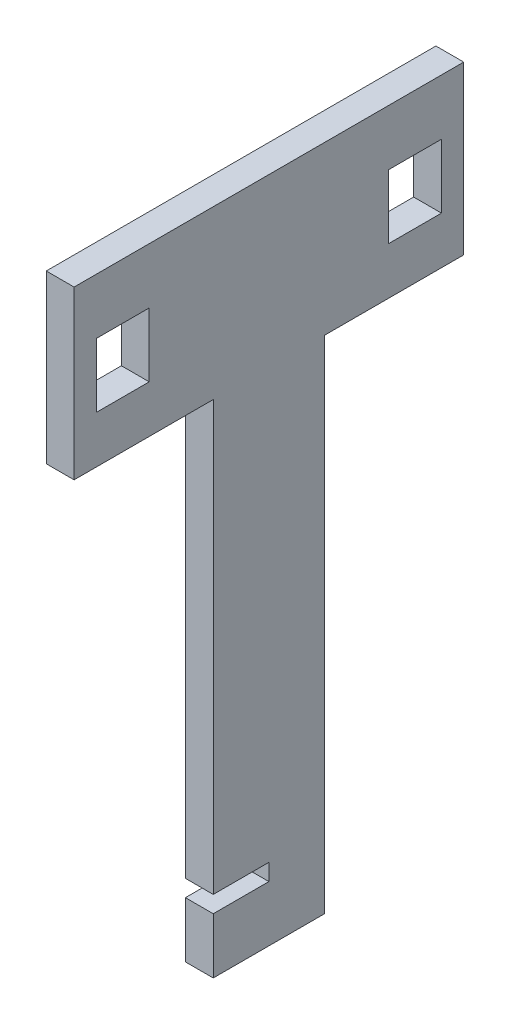
ISO-10303-21;
HEADER;
FILE_DESCRIPTION(('STEP AP214'),'2;1');
FILE_NAME('part.step','',(''),(''),'','','');
FILE_SCHEMA(('AUTOMOTIVE_DESIGN { 1 0 10303 214 1 1 1 1 }'));
ENDSEC;
DATA;
#1=APPLICATION_CONTEXT('core data for automotive mechanical design processes');
#2=APPLICATION_PROTOCOL_DEFINITION('international standard','automotive_design',2000,#1);
#3=PRODUCT_CONTEXT('',#1,'mechanical');
#4=PRODUCT('Part','Part','',(#3));
#5=PRODUCT_RELATED_PRODUCT_CATEGORY('part','',(#4));
#6=PRODUCT_DEFINITION_FORMATION('','',#4);
#7=PRODUCT_DEFINITION_CONTEXT('part definition',#1,'design');
#8=PRODUCT_DEFINITION('design','',#6,#7);
#9=PRODUCT_DEFINITION_SHAPE('','',#8);
#10=(LENGTH_UNIT() NAMED_UNIT(*) SI_UNIT(.MILLI.,.METRE.));
#11=(NAMED_UNIT(*) PLANE_ANGLE_UNIT() SI_UNIT($,.RADIAN.));
#12=(NAMED_UNIT(*) SI_UNIT($,.STERADIAN.) SOLID_ANGLE_UNIT());
#13=UNCERTAINTY_MEASURE_WITH_UNIT(LENGTH_MEASURE(1.E-05),#10,'distance_accuracy_value','');
#14=(GEOMETRIC_REPRESENTATION_CONTEXT(3) GLOBAL_UNCERTAINTY_ASSIGNED_CONTEXT((#13)) GLOBAL_UNIT_ASSIGNED_CONTEXT((#10,
#11,#12)) REPRESENTATION_CONTEXT('',''));
#15=CARTESIAN_POINT('',(0.,0.,0.));
#16=DIRECTION('',(0.,0.,1.));
#17=DIRECTION('',(1.,0.,0.));
#18=AXIS2_PLACEMENT_3D('',#15,#16,#17);
#19=CARTESIAN_POINT('',(0.,0.,70.));
#20=DIRECTION('',(-1.,0.,0.));
#21=DIRECTION('',(0.,0.,1.));
#22=AXIS2_PLACEMENT_3D('',#19,#20,#21);
#23=PLANE('',#22);
#24=DIRECTION('',(0.,0.,-1.));
#25=VECTOR('',#24,1.);
#26=CARTESIAN_POINT('',(0.,90.,70.));
#27=LINE('',#26,#25);
#28=CARTESIAN_POINT('',(0.,90.,70.));
#29=VERTEX_POINT('',#28);
#30=CARTESIAN_POINT('',(0.,90.,45.));
#31=VERTEX_POINT('',#30);
#32=EDGE_CURVE('E252',#29,#31,#27,.T.);
#33=ORIENTED_EDGE('',*,*,#32,.F.);
#34=DIRECTION('',(0.,1.,0.));
#35=VECTOR('',#34,1.);
#36=CARTESIAN_POINT('',(0.,0.,70.));
#37=LINE('',#36,#35);
#38=CARTESIAN_POINT('',(0.,120.,70.));
#39=VERTEX_POINT('',#38);
#40=EDGE_CURVE('E373',#29,#39,#37,.T.);
#41=ORIENTED_EDGE('',*,*,#40,.T.);
#42=DIRECTION('',(0.,0.,-1.));
#43=VECTOR('',#42,1.);
#44=CARTESIAN_POINT('',(0.,120.,70.));
#45=LINE('',#44,#43);
#46=CARTESIAN_POINT('',(0.,120.,0.));
#47=VERTEX_POINT('',#46);
#48=EDGE_CURVE('E216',#39,#47,#45,.T.);
#49=ORIENTED_EDGE('',*,*,#48,.T.);
#50=DIRECTION('',(0.,1.,0.));
#51=VECTOR('',#50,1.);
#52=CARTESIAN_POINT('',(0.,0.,0.));
#53=LINE('',#52,#51);
#54=CARTESIAN_POINT('',(0.,90.,0.));
#55=VERTEX_POINT('',#54);
#56=EDGE_CURVE('E382',#55,#47,#53,.T.);
#57=ORIENTED_EDGE('',*,*,#56,.F.);
#58=DIRECTION('',(0.,0.,-1.));
#59=VECTOR('',#58,1.);
#60=CARTESIAN_POINT('',(0.,90.,70.));
#61=LINE('',#60,#59);
#62=CARTESIAN_POINT('',(0.,90.,25.));
#63=VERTEX_POINT('',#62);
#64=EDGE_CURVE('E57',#63,#55,#61,.T.);
#65=ORIENTED_EDGE('',*,*,#64,.F.);
#66=DIRECTION('',(0.,1.,0.));
#67=VECTOR('',#66,1.);
#68=CARTESIAN_POINT('',(0.,0.,25.));
#69=LINE('',#68,#67);
#70=CARTESIAN_POINT('',(0.,0.,25.));
#71=VERTEX_POINT('',#70);
#72=EDGE_CURVE('E249',#71,#63,#69,.T.);
#73=ORIENTED_EDGE('',*,*,#72,.F.);
#74=DIRECTION('',(0.,0.,-1.));
#75=VECTOR('',#74,1.);
#76=CARTESIAN_POINT('',(0.,0.,70.));
#77=LINE('',#76,#75);
#78=CARTESIAN_POINT('',(0.,0.,45.));
#79=VERTEX_POINT('',#78);
#80=EDGE_CURVE('E211',#79,#71,#77,.T.);
#81=ORIENTED_EDGE('',*,*,#80,.F.);
#82=DIRECTION('',(0.,-1.,0.));
#83=VECTOR('',#82,1.);
#84=CARTESIAN_POINT('',(0.,0.,45.));
#85=LINE('',#84,#83);
#86=CARTESIAN_POINT('',(0.,10.,45.));
#87=VERTEX_POINT('',#86);
#88=EDGE_CURVE('E185',#87,#79,#85,.T.);
#89=ORIENTED_EDGE('',*,*,#88,.F.);
#90=DIRECTION('',(0.,0.,-1.));
#91=VECTOR('',#90,1.);
#92=CARTESIAN_POINT('',(0.,10.,70.));
#93=LINE('',#92,#91);
#94=CARTESIAN_POINT('',(0.,10.,35.));
#95=VERTEX_POINT('',#94);
#96=EDGE_CURVE('E231',#87,#95,#93,.T.);
#97=ORIENTED_EDGE('',*,*,#96,.T.);
#98=DIRECTION('',(0.,1.,0.));
#99=VECTOR('',#98,1.);
#100=CARTESIAN_POINT('',(0.,10.,35.));
#101=LINE('',#100,#99);
#102=CARTESIAN_POINT('',(0.,13.,35.));
#103=VERTEX_POINT('',#102);
#104=EDGE_CURVE('E345',#95,#103,#101,.T.);
#105=ORIENTED_EDGE('',*,*,#104,.T.);
#106=DIRECTION('',(0.,0.,1.));
#107=VECTOR('',#106,1.);
#108=CARTESIAN_POINT('',(0.,13.,70.));
#109=LINE('',#108,#107);
#110=CARTESIAN_POINT('',(0.,13.,45.));
#111=VERTEX_POINT('',#110);
#112=EDGE_CURVE('E349',#103,#111,#109,.T.);
#113=ORIENTED_EDGE('',*,*,#112,.T.);
#114=EDGE_CURVE('E64',#31,#111,#85,.T.);
#115=ORIENTED_EDGE('',*,*,#114,.F.);
#116=EDGE_LOOP('',(#33,#41,#49,#57,#65,#73,#81,#89,#97,#105,#113,#115));
#117=FACE_BOUND('',#116,.T.);
#118=DIRECTION('',(0.,0.,-1.));
#119=VECTOR('',#118,1.);
#120=CARTESIAN_POINT('',(0.,98.5,70.0000000000001));
#121=LINE('',#120,#119);
#122=CARTESIAN_POINT('',(0.,98.5,66.));
#123=VERTEX_POINT('',#122);
#124=CARTESIAN_POINT('',(0.,98.5,56.5));
#125=VERTEX_POINT('',#124);
#126=EDGE_CURVE('E306',#123,#125,#121,.T.);
#127=ORIENTED_EDGE('',*,*,#126,.T.);
#128=DIRECTION('',(0.,1.,0.));
#129=VECTOR('',#128,1.);
#130=CARTESIAN_POINT('',(0.,0.,56.4999999999999));
#131=LINE('',#130,#129);
#132=CARTESIAN_POINT('',(0.,110.,56.5));
#133=VERTEX_POINT('',#132);
#134=EDGE_CURVE('E257',#125,#133,#131,.T.);
#135=ORIENTED_EDGE('',*,*,#134,.T.);
#136=DIRECTION('',(0.,0.,1.));
#137=VECTOR('',#136,1.);
#138=CARTESIAN_POINT('',(0.,110.,70.0000000000002));
#139=LINE('',#138,#137);
#140=CARTESIAN_POINT('',(0.,110.,66.));
#141=VERTEX_POINT('',#140);
#142=EDGE_CURVE('E320',#133,#141,#139,.T.);
#143=ORIENTED_EDGE('',*,*,#142,.T.);
#144=DIRECTION('',(0.,-1.,0.));
#145=VECTOR('',#144,1.);
#146=CARTESIAN_POINT('',(0.,0.,66.));
#147=LINE('',#146,#145);
#148=EDGE_CURVE('E324',#141,#123,#147,.T.);
#149=ORIENTED_EDGE('',*,*,#148,.T.);
#150=EDGE_LOOP('',(#127,#135,#143,#149));
#151=FACE_BOUND('',#150,.T.);
#152=DIRECTION('',(0.,0.,1.));
#153=VECTOR('',#152,1.);
#154=CARTESIAN_POINT('',(0.,110.,70.));
#155=LINE('',#154,#153);
#156=CARTESIAN_POINT('',(0.,110.,4.));
#157=VERTEX_POINT('',#156);
#158=CARTESIAN_POINT('',(0.,110.,13.5));
#159=VERTEX_POINT('',#158);
#160=EDGE_CURVE('E262',#157,#159,#155,.T.);
#161=ORIENTED_EDGE('',*,*,#160,.T.);
#162=DIRECTION('',(0.,-1.,0.));
#163=VECTOR('',#162,1.);
#164=CARTESIAN_POINT('',(0.,0.,13.5));
#165=LINE('',#164,#163);
#166=CARTESIAN_POINT('',(0.,98.5,13.5));
#167=VERTEX_POINT('',#166);
#168=EDGE_CURVE('E273',#159,#167,#165,.T.);
#169=ORIENTED_EDGE('',*,*,#168,.T.);
#170=DIRECTION('',(0.,0.,-1.));
#171=VECTOR('',#170,1.);
#172=CARTESIAN_POINT('',(0.,98.5,70.));
#173=LINE('',#172,#171);
#174=CARTESIAN_POINT('',(0.,98.5,4.));
#175=VERTEX_POINT('',#174);
#176=EDGE_CURVE('E277',#167,#175,#173,.T.);
#177=ORIENTED_EDGE('',*,*,#176,.T.);
#178=DIRECTION('',(0.,1.,0.));
#179=VECTOR('',#178,1.);
#180=CARTESIAN_POINT('',(0.,0.,3.99999999999999));
#181=LINE('',#180,#179);
#182=EDGE_CURVE('E282',#175,#157,#181,.T.);
#183=ORIENTED_EDGE('',*,*,#182,.T.);
#184=EDGE_LOOP('',(#161,#169,#177,#183));
#185=FACE_BOUND('',#184,.T.);
#186=ADVANCED_FACE('F41',(#117,#151,#185),#23,.T.);
#187=CARTESIAN_POINT('',(5.,0.,70.));
#188=DIRECTION('',(-1.,0.,0.));
#189=DIRECTION('',(0.,0.,1.));
#190=AXIS2_PLACEMENT_3D('',#187,#188,#189);
#191=PLANE('',#190);
#192=DIRECTION('',(0.,1.,0.));
#193=VECTOR('',#192,1.);
#194=CARTESIAN_POINT('',(5.,0.,56.4999999999999));
#195=LINE('',#194,#193);
#196=CARTESIAN_POINT('',(5.,98.5,56.5));
#197=VERTEX_POINT('',#196);
#198=CARTESIAN_POINT('',(5.,110.,56.5));
#199=VERTEX_POINT('',#198);
#200=EDGE_CURVE('E302',#197,#199,#195,.T.);
#201=ORIENTED_EDGE('',*,*,#200,.F.);
#202=DIRECTION('',(0.,0.,-1.));
#203=VECTOR('',#202,1.);
#204=CARTESIAN_POINT('',(5.,98.5,70.0000000000001));
#205=LINE('',#204,#203);
#206=CARTESIAN_POINT('',(5.,98.5,66.));
#207=VERTEX_POINT('',#206);
#208=EDGE_CURVE('E313',#207,#197,#205,.T.);
#209=ORIENTED_EDGE('',*,*,#208,.F.);
#210=DIRECTION('',(0.,-1.,0.));
#211=VECTOR('',#210,1.);
#212=CARTESIAN_POINT('',(5.,0.,66.));
#213=LINE('',#212,#211);
#214=CARTESIAN_POINT('',(5.,110.,66.));
#215=VERTEX_POINT('',#214);
#216=EDGE_CURVE('E309',#215,#207,#213,.T.);
#217=ORIENTED_EDGE('',*,*,#216,.F.);
#218=DIRECTION('',(0.,0.,1.));
#219=VECTOR('',#218,1.);
#220=CARTESIAN_POINT('',(5.,110.,70.0000000000002));
#221=LINE('',#220,#219);
#222=EDGE_CURVE('E305',#199,#215,#221,.T.);
#223=ORIENTED_EDGE('',*,*,#222,.F.);
#224=EDGE_LOOP('',(#201,#209,#217,#223));
#225=FACE_BOUND('',#224,.T.);
#226=DIRECTION('',(0.,1.,0.));
#227=VECTOR('',#226,1.);
#228=CARTESIAN_POINT('',(5.,0.,70.));
#229=LINE('',#228,#227);
#230=CARTESIAN_POINT('',(5.,90.,70.));
#231=VERTEX_POINT('',#230);
#232=CARTESIAN_POINT('',(5.,120.,70.));
#233=VERTEX_POINT('',#232);
#234=EDGE_CURVE('E219',#231,#233,#229,.T.);
#235=ORIENTED_EDGE('',*,*,#234,.F.);
#236=DIRECTION('',(0.,0.,1.));
#237=VECTOR('',#236,1.);
#238=CARTESIAN_POINT('',(5.,90.,70.));
#239=LINE('',#238,#237);
#240=CARTESIAN_POINT('',(5.,90.,45.));
#241=VERTEX_POINT('',#240);
#242=EDGE_CURVE('E192',#241,#231,#239,.T.);
#243=ORIENTED_EDGE('',*,*,#242,.F.);
#244=DIRECTION('',(0.,1.,0.));
#245=VECTOR('',#244,1.);
#246=CARTESIAN_POINT('',(5.,90.,45.));
#247=LINE('',#246,#245);
#248=CARTESIAN_POINT('',(5.,13.,45.));
#249=VERTEX_POINT('',#248);
#250=EDGE_CURVE('E205',#249,#241,#247,.T.);
#251=ORIENTED_EDGE('',*,*,#250,.F.);
#252=DIRECTION('',(0.,0.,1.));
#253=VECTOR('',#252,1.);
#254=CARTESIAN_POINT('',(5.,13.,70.));
#255=LINE('',#254,#253);
#256=CARTESIAN_POINT('',(5.,13.,35.));
#257=VERTEX_POINT('',#256);
#258=EDGE_CURVE('E346',#257,#249,#255,.T.);
#259=ORIENTED_EDGE('',*,*,#258,.F.);
#260=DIRECTION('',(0.,1.,0.));
#261=VECTOR('',#260,1.);
#262=CARTESIAN_POINT('',(5.,10.,35.));
#263=LINE('',#262,#261);
#264=CARTESIAN_POINT('',(5.,10.,35.));
#265=VERTEX_POINT('',#264);
#266=EDGE_CURVE('E356',#265,#257,#263,.T.);
#267=ORIENTED_EDGE('',*,*,#266,.F.);
#268=DIRECTION('',(0.,0.,-1.));
#269=VECTOR('',#268,1.);
#270=CARTESIAN_POINT('',(5.,10.,70.));
#271=LINE('',#270,#269);
#272=CARTESIAN_POINT('',(5.,10.,45.));
#273=VERTEX_POINT('',#272);
#274=EDGE_CURVE('E203',#273,#265,#271,.T.);
#275=ORIENTED_EDGE('',*,*,#274,.F.);
#276=CARTESIAN_POINT('',(5.,0.,45.));
#277=VERTEX_POINT('',#276);
#278=EDGE_CURVE('E182',#277,#273,#247,.T.);
#279=ORIENTED_EDGE('',*,*,#278,.F.);
#280=DIRECTION('',(0.,0.,-1.));
#281=VECTOR('',#280,1.);
#282=CARTESIAN_POINT('',(5.,0.,70.));
#283=LINE('',#282,#281);
#284=CARTESIAN_POINT('',(5.,0.,25.));
#285=VERTEX_POINT('',#284);
#286=EDGE_CURVE('E201',#277,#285,#283,.T.);
#287=ORIENTED_EDGE('',*,*,#286,.T.);
#288=DIRECTION('',(0.,-1.,0.));
#289=VECTOR('',#288,1.);
#290=CARTESIAN_POINT('',(5.,90.,25.));
#291=LINE('',#290,#289);
#292=CARTESIAN_POINT('',(5.,90.,25.));
#293=VERTEX_POINT('',#292);
#294=EDGE_CURVE('E412',#293,#285,#291,.T.);
#295=ORIENTED_EDGE('',*,*,#294,.F.);
#296=DIRECTION('',(0.,0.,1.));
#297=VECTOR('',#296,1.);
#298=CARTESIAN_POINT('',(5.,90.,0.));
#299=LINE('',#298,#297);
#300=CARTESIAN_POINT('',(5.,90.,0.));
#301=VERTEX_POINT('',#300);
#302=EDGE_CURVE('E389',#301,#293,#299,.T.);
#303=ORIENTED_EDGE('',*,*,#302,.F.);
#304=DIRECTION('',(0.,1.,0.));
#305=VECTOR('',#304,1.);
#306=CARTESIAN_POINT('',(5.,0.,0.));
#307=LINE('',#306,#305);
#308=CARTESIAN_POINT('',(5.,120.,0.));
#309=VERTEX_POINT('',#308);
#310=EDGE_CURVE('E374',#301,#309,#307,.T.);
#311=ORIENTED_EDGE('',*,*,#310,.T.);
#312=DIRECTION('',(0.,0.,-1.));
#313=VECTOR('',#312,1.);
#314=CARTESIAN_POINT('',(5.,120.,70.));
#315=LINE('',#314,#313);
#316=EDGE_CURVE('E212',#233,#309,#315,.T.);
#317=ORIENTED_EDGE('',*,*,#316,.F.);
#318=EDGE_LOOP('',(#235,#243,#251,#259,#267,#275,#279,#287,#295,#303,#311,#317));
#319=FACE_BOUND('',#318,.T.);
#320=DIRECTION('',(0.,-1.,0.));
#321=VECTOR('',#320,1.);
#322=CARTESIAN_POINT('',(5.,0.,13.5));
#323=LINE('',#322,#321);
#324=CARTESIAN_POINT('',(5.,110.,13.5));
#325=VERTEX_POINT('',#324);
#326=CARTESIAN_POINT('',(5.,98.5,13.5));
#327=VERTEX_POINT('',#326);
#328=EDGE_CURVE('E258',#325,#327,#323,.T.);
#329=ORIENTED_EDGE('',*,*,#328,.F.);
#330=DIRECTION('',(0.,0.,1.));
#331=VECTOR('',#330,1.);
#332=CARTESIAN_POINT('',(5.,110.,70.));
#333=LINE('',#332,#331);
#334=CARTESIAN_POINT('',(5.,110.,4.));
#335=VERTEX_POINT('',#334);
#336=EDGE_CURVE('E269',#335,#325,#333,.T.);
#337=ORIENTED_EDGE('',*,*,#336,.F.);
#338=DIRECTION('',(0.,1.,0.));
#339=VECTOR('',#338,1.);
#340=CARTESIAN_POINT('',(5.,0.,3.99999999999999));
#341=LINE('',#340,#339);
#342=CARTESIAN_POINT('',(5.,98.5,4.));
#343=VERTEX_POINT('',#342);
#344=EDGE_CURVE('E265',#343,#335,#341,.T.);
#345=ORIENTED_EDGE('',*,*,#344,.F.);
#346=DIRECTION('',(0.,0.,-1.));
#347=VECTOR('',#346,1.);
#348=CARTESIAN_POINT('',(5.,98.5,70.));
#349=LINE('',#348,#347);
#350=EDGE_CURVE('E261',#327,#343,#349,.T.);
#351=ORIENTED_EDGE('',*,*,#350,.F.);
#352=EDGE_LOOP('',(#329,#337,#345,#351));
#353=FACE_BOUND('',#352,.T.);
#354=ADVANCED_FACE('F198',(#225,#319,#353),#191,.F.);
#355=CARTESIAN_POINT('',(0.,0.,70.));
#356=DIRECTION('',(0.,0.,1.));
#357=DIRECTION('',(1.,0.,0.));
#358=AXIS2_PLACEMENT_3D('',#355,#356,#357);
#359=PLANE('',#358);
#360=DIRECTION('',(1.,0.,0.));
#361=VECTOR('',#360,1.);
#362=CARTESIAN_POINT('',(-5.,90.,70.));
#363=LINE('',#362,#361);
#364=EDGE_CURVE('E239',#29,#231,#363,.T.);
#365=ORIENTED_EDGE('',*,*,#364,.T.);
#366=ORIENTED_EDGE('',*,*,#234,.T.);
#367=DIRECTION('',(1.,0.,0.));
#368=VECTOR('',#367,1.);
#369=CARTESIAN_POINT('',(0.,120.,70.));
#370=LINE('',#369,#368);
#371=EDGE_CURVE('E369',#39,#233,#370,.T.);
#372=ORIENTED_EDGE('',*,*,#371,.F.);
#373=ORIENTED_EDGE('',*,*,#40,.F.);
#374=EDGE_LOOP('',(#365,#366,#372,#373));
#375=FACE_BOUND('',#374,.T.);
#376=ADVANCED_FACE('F399',(#375),#359,.T.);
#377=CARTESIAN_POINT('',(0.,120.,70.));
#378=DIRECTION('',(0.,1.,0.));
#379=DIRECTION('',(0.,0.,1.));
#380=AXIS2_PLACEMENT_3D('',#377,#378,#379);
#381=PLANE('',#380);
#382=DIRECTION('',(1.,0.,0.));
#383=VECTOR('',#382,1.);
#384=CARTESIAN_POINT('',(0.,120.,0.));
#385=LINE('',#384,#383);
#386=EDGE_CURVE('E366',#47,#309,#385,.T.);
#387=ORIENTED_EDGE('',*,*,#386,.F.);
#388=ORIENTED_EDGE('',*,*,#48,.F.);
#389=ORIENTED_EDGE('',*,*,#371,.T.);
#390=ORIENTED_EDGE('',*,*,#316,.T.);
#391=EDGE_LOOP('',(#387,#388,#389,#390));
#392=FACE_BOUND('',#391,.T.);
#393=ADVANCED_FACE('F43',(#392),#381,.T.);
#394=CARTESIAN_POINT('',(0.,0.,70.));
#395=DIRECTION('',(0.,1.,0.));
#396=DIRECTION('',(0.,0.,1.));
#397=AXIS2_PLACEMENT_3D('',#394,#395,#396);
#398=PLANE('',#397);
#399=ORIENTED_EDGE('',*,*,#286,.F.);
#400=DIRECTION('',(1.,0.,0.));
#401=VECTOR('',#400,1.);
#402=CARTESIAN_POINT('',(-5.,0.,45.));
#403=LINE('',#402,#401);
#404=EDGE_CURVE('E179',#79,#277,#403,.T.);
#405=ORIENTED_EDGE('',*,*,#404,.F.);
#406=ORIENTED_EDGE('',*,*,#80,.T.);
#407=DIRECTION('',(1.,0.,0.));
#408=VECTOR('',#407,1.);
#409=CARTESIAN_POINT('',(-5.,0.,25.));
#410=LINE('',#409,#408);
#411=EDGE_CURVE('E209',#71,#285,#410,.T.);
#412=ORIENTED_EDGE('',*,*,#411,.T.);
#413=EDGE_LOOP('',(#399,#405,#406,#412));
#414=FACE_BOUND('',#413,.T.);
#415=ADVANCED_FACE('F208',(#414),#398,.F.);
#416=CARTESIAN_POINT('',(0.,0.,0.));
#417=DIRECTION('',(0.,0.,1.));
#418=DIRECTION('',(1.,0.,0.));
#419=AXIS2_PLACEMENT_3D('',#416,#417,#418);
#420=PLANE('',#419);
#421=ORIENTED_EDGE('',*,*,#310,.F.);
#422=DIRECTION('',(-1.,0.,0.));
#423=VECTOR('',#422,1.);
#424=CARTESIAN_POINT('',(0.,90.,0.));
#425=LINE('',#424,#423);
#426=EDGE_CURVE('E11',#301,#55,#425,.T.);
#427=ORIENTED_EDGE('',*,*,#426,.T.);
#428=ORIENTED_EDGE('',*,*,#56,.T.);
#429=ORIENTED_EDGE('',*,*,#386,.T.);
#430=EDGE_LOOP('',(#421,#427,#428,#429));
#431=FACE_BOUND('',#430,.T.);
#432=ADVANCED_FACE('F395',(#431),#420,.F.);
#433=CARTESIAN_POINT('',(0.,13.,70.));
#434=DIRECTION('',(0.,1.,0.));
#435=DIRECTION('',(0.,0.,1.));
#436=AXIS2_PLACEMENT_3D('',#433,#434,#435);
#437=PLANE('',#436);
#438=ORIENTED_EDGE('',*,*,#258,.T.);
#439=DIRECTION('',(-1.,0.,0.));
#440=VECTOR('',#439,1.);
#441=CARTESIAN_POINT('',(0.,13.,45.));
#442=LINE('',#441,#440);
#443=EDGE_CURVE('E238',#249,#111,#442,.T.);
#444=ORIENTED_EDGE('',*,*,#443,.T.);
#445=ORIENTED_EDGE('',*,*,#112,.F.);
#446=DIRECTION('',(1.,0.,0.));
#447=VECTOR('',#446,1.);
#448=CARTESIAN_POINT('',(0.,13.,35.));
#449=LINE('',#448,#447);
#450=EDGE_CURVE('E363',#103,#257,#449,.T.);
#451=ORIENTED_EDGE('',*,*,#450,.T.);
#452=EDGE_LOOP('',(#438,#444,#445,#451));
#453=FACE_BOUND('',#452,.T.);
#454=ADVANCED_FACE('F440',(#453),#437,.F.);
#455=CARTESIAN_POINT('',(0.,10.,35.));
#456=DIRECTION('',(0.,0.,-1.));
#457=DIRECTION('',(-1.,0.,0.));
#458=AXIS2_PLACEMENT_3D('',#455,#456,#457);
#459=PLANE('',#458);
#460=ORIENTED_EDGE('',*,*,#266,.T.);
#461=ORIENTED_EDGE('',*,*,#450,.F.);
#462=ORIENTED_EDGE('',*,*,#104,.F.);
#463=DIRECTION('',(1.,0.,0.));
#464=VECTOR('',#463,1.);
#465=CARTESIAN_POINT('',(0.,10.,35.));
#466=LINE('',#465,#464);
#467=EDGE_CURVE('E353',#95,#265,#466,.T.);
#468=ORIENTED_EDGE('',*,*,#467,.T.);
#469=EDGE_LOOP('',(#460,#461,#462,#468));
#470=FACE_BOUND('',#469,.T.);
#471=ADVANCED_FACE('F446',(#470),#459,.F.);
#472=CARTESIAN_POINT('',(0.,10.,70.));
#473=DIRECTION('',(0.,-1.,0.));
#474=DIRECTION('',(0.,0.,-1.));
#475=AXIS2_PLACEMENT_3D('',#472,#473,#474);
#476=PLANE('',#475);
#477=ORIENTED_EDGE('',*,*,#96,.F.);
#478=DIRECTION('',(1.,0.,0.));
#479=VECTOR('',#478,1.);
#480=CARTESIAN_POINT('',(0.,10.,45.));
#481=LINE('',#480,#479);
#482=EDGE_CURVE('E50',#87,#273,#481,.T.);
#483=ORIENTED_EDGE('',*,*,#482,.T.);
#484=ORIENTED_EDGE('',*,*,#274,.T.);
#485=ORIENTED_EDGE('',*,*,#467,.F.);
#486=EDGE_LOOP('',(#477,#483,#484,#485));
#487=FACE_BOUND('',#486,.T.);
#488=ADVANCED_FACE('F228',(#487),#476,.F.);
#489=CARTESIAN_POINT('',(5.,0.,56.4999999999999));
#490=DIRECTION('',(0.,0.,1.));
#491=DIRECTION('',(0.,-1.,0.));
#492=AXIS2_PLACEMENT_3D('',#489,#490,#491);
#493=PLANE('',#492);
#494=ORIENTED_EDGE('',*,*,#134,.F.);
#495=DIRECTION('',(-1.,0.,0.));
#496=VECTOR('',#495,1.);
#497=CARTESIAN_POINT('',(5.,98.5,56.5));
#498=LINE('',#497,#496);
#499=EDGE_CURVE('E316',#197,#125,#498,.T.);
#500=ORIENTED_EDGE('',*,*,#499,.F.);
#501=ORIENTED_EDGE('',*,*,#200,.T.);
#502=DIRECTION('',(-1.,0.,0.));
#503=VECTOR('',#502,1.);
#504=CARTESIAN_POINT('',(5.,110.,56.5));
#505=LINE('',#504,#503);
#506=EDGE_CURVE('E278',#199,#133,#505,.T.);
#507=ORIENTED_EDGE('',*,*,#506,.T.);
#508=EDGE_LOOP('',(#494,#500,#501,#507));
#509=FACE_BOUND('',#508,.T.);
#510=ADVANCED_FACE('F445',(#509),#493,.T.);
#511=CARTESIAN_POINT('',(5.,110.,70.0000000000002));
#512=DIRECTION('',(0.,-1.,0.));
#513=DIRECTION('',(0.,0.,-1.));
#514=AXIS2_PLACEMENT_3D('',#511,#512,#513);
#515=PLANE('',#514);
#516=ORIENTED_EDGE('',*,*,#142,.F.);
#517=ORIENTED_EDGE('',*,*,#506,.F.);
#518=ORIENTED_EDGE('',*,*,#222,.T.);
#519=DIRECTION('',(-1.,0.,0.));
#520=VECTOR('',#519,1.);
#521=CARTESIAN_POINT('',(5.,110.,66.));
#522=LINE('',#521,#520);
#523=EDGE_CURVE('E337',#215,#141,#522,.T.);
#524=ORIENTED_EDGE('',*,*,#523,.T.);
#525=EDGE_LOOP('',(#516,#517,#518,#524));
#526=FACE_BOUND('',#525,.T.);
#527=ADVANCED_FACE('F455',(#526),#515,.T.);
#528=CARTESIAN_POINT('',(5.,0.,66.));
#529=DIRECTION('',(0.,0.,-1.));
#530=DIRECTION('',(-1.,0.,0.));
#531=AXIS2_PLACEMENT_3D('',#528,#529,#530);
#532=PLANE('',#531);
#533=ORIENTED_EDGE('',*,*,#148,.F.);
#534=ORIENTED_EDGE('',*,*,#523,.F.);
#535=ORIENTED_EDGE('',*,*,#216,.T.);
#536=DIRECTION('',(-1.,0.,0.));
#537=VECTOR('',#536,1.);
#538=CARTESIAN_POINT('',(5.,98.5,66.));
#539=LINE('',#538,#537);
#540=EDGE_CURVE('E334',#207,#123,#539,.T.);
#541=ORIENTED_EDGE('',*,*,#540,.T.);
#542=EDGE_LOOP('',(#533,#534,#535,#541));
#543=FACE_BOUND('',#542,.T.);
#544=ADVANCED_FACE('F459',(#543),#532,.T.);
#545=CARTESIAN_POINT('',(5.,98.5,70.0000000000001));
#546=DIRECTION('',(0.,1.,0.));
#547=DIRECTION('',(0.,0.,1.));
#548=AXIS2_PLACEMENT_3D('',#545,#546,#547);
#549=PLANE('',#548);
#550=ORIENTED_EDGE('',*,*,#126,.F.);
#551=ORIENTED_EDGE('',*,*,#540,.F.);
#552=ORIENTED_EDGE('',*,*,#208,.T.);
#553=ORIENTED_EDGE('',*,*,#499,.T.);
#554=EDGE_LOOP('',(#550,#551,#552,#553));
#555=FACE_BOUND('',#554,.T.);
#556=ADVANCED_FACE('F463',(#555),#549,.T.);
#557=CARTESIAN_POINT('',(5.,0.,13.5));
#558=DIRECTION('',(0.,0.,-1.));
#559=DIRECTION('',(0.,1.,0.));
#560=AXIS2_PLACEMENT_3D('',#557,#558,#559);
#561=PLANE('',#560);
#562=ORIENTED_EDGE('',*,*,#168,.F.);
#563=DIRECTION('',(-1.,0.,0.));
#564=VECTOR('',#563,1.);
#565=CARTESIAN_POINT('',(5.,110.,13.5));
#566=LINE('',#565,#564);
#567=EDGE_CURVE('E272',#325,#159,#566,.T.);
#568=ORIENTED_EDGE('',*,*,#567,.F.);
#569=ORIENTED_EDGE('',*,*,#328,.T.);
#570=DIRECTION('',(-1.,0.,0.));
#571=VECTOR('',#570,1.);
#572=CARTESIAN_POINT('',(5.,98.5,13.5));
#573=LINE('',#572,#571);
#574=EDGE_CURVE('E298',#327,#167,#573,.T.);
#575=ORIENTED_EDGE('',*,*,#574,.T.);
#576=EDGE_LOOP('',(#562,#568,#569,#575));
#577=FACE_BOUND('',#576,.T.);
#578=ADVANCED_FACE('F467',(#577),#561,.T.);
#579=CARTESIAN_POINT('',(5.,98.5,70.));
#580=DIRECTION('',(0.,1.,0.));
#581=DIRECTION('',(0.,0.,1.));
#582=AXIS2_PLACEMENT_3D('',#579,#580,#581);
#583=PLANE('',#582);
#584=ORIENTED_EDGE('',*,*,#176,.F.);
#585=ORIENTED_EDGE('',*,*,#574,.F.);
#586=ORIENTED_EDGE('',*,*,#350,.T.);
#587=DIRECTION('',(-1.,0.,0.));
#588=VECTOR('',#587,1.);
#589=CARTESIAN_POINT('',(5.,98.5,4.));
#590=LINE('',#589,#588);
#591=EDGE_CURVE('E295',#343,#175,#590,.T.);
#592=ORIENTED_EDGE('',*,*,#591,.T.);
#593=EDGE_LOOP('',(#584,#585,#586,#592));
#594=FACE_BOUND('',#593,.T.);
#595=ADVANCED_FACE('F471',(#594),#583,.T.);
#596=CARTESIAN_POINT('',(5.,0.,3.99999999999999));
#597=DIRECTION('',(0.,0.,1.));
#598=DIRECTION('',(0.,-1.,0.));
#599=AXIS2_PLACEMENT_3D('',#596,#597,#598);
#600=PLANE('',#599);
#601=ORIENTED_EDGE('',*,*,#182,.F.);
#602=ORIENTED_EDGE('',*,*,#591,.F.);
#603=ORIENTED_EDGE('',*,*,#344,.T.);
#604=DIRECTION('',(-1.,0.,0.));
#605=VECTOR('',#604,1.);
#606=CARTESIAN_POINT('',(5.,110.,4.));
#607=LINE('',#606,#605);
#608=EDGE_CURVE('E292',#335,#157,#607,.T.);
#609=ORIENTED_EDGE('',*,*,#608,.T.);
#610=EDGE_LOOP('',(#601,#602,#603,#609));
#611=FACE_BOUND('',#610,.T.);
#612=ADVANCED_FACE('F475',(#611),#600,.T.);
#613=CARTESIAN_POINT('',(5.,110.,70.));
#614=DIRECTION('',(0.,-1.,0.));
#615=DIRECTION('',(0.,0.,-1.));
#616=AXIS2_PLACEMENT_3D('',#613,#614,#615);
#617=PLANE('',#616);
#618=ORIENTED_EDGE('',*,*,#160,.F.);
#619=ORIENTED_EDGE('',*,*,#608,.F.);
#620=ORIENTED_EDGE('',*,*,#336,.T.);
#621=ORIENTED_EDGE('',*,*,#567,.T.);
#622=EDGE_LOOP('',(#618,#619,#620,#621));
#623=FACE_BOUND('',#622,.T.);
#624=ADVANCED_FACE('F478',(#623),#617,.T.);
#625=CARTESIAN_POINT('',(-5.,90.,45.));
#626=DIRECTION('',(0.,0.,-1.));
#627=DIRECTION('',(0.,1.,0.));
#628=AXIS2_PLACEMENT_3D('',#625,#626,#627);
#629=PLANE('',#628);
#630=ORIENTED_EDGE('',*,*,#88,.T.);
#631=ORIENTED_EDGE('',*,*,#404,.T.);
#632=ORIENTED_EDGE('',*,*,#278,.T.);
#633=ORIENTED_EDGE('',*,*,#482,.F.);
#634=EDGE_LOOP('',(#630,#631,#632,#633));
#635=FACE_BOUND('',#634,.T.);
#636=ADVANCED_FACE('F181',(#635),#629,.F.);
#637=ORIENTED_EDGE('',*,*,#114,.T.);
#638=ORIENTED_EDGE('',*,*,#443,.F.);
#639=ORIENTED_EDGE('',*,*,#250,.T.);
#640=DIRECTION('',(1.,0.,0.));
#641=VECTOR('',#640,1.);
#642=CARTESIAN_POINT('',(-5.,90.,45.));
#643=LINE('',#642,#641);
#644=EDGE_CURVE('E191',#31,#241,#643,.T.);
#645=ORIENTED_EDGE('',*,*,#644,.F.);
#646=EDGE_LOOP('',(#637,#638,#639,#645));
#647=FACE_BOUND('',#646,.T.);
#648=ADVANCED_FACE('F485',(#647),#629,.F.);
#649=CARTESIAN_POINT('',(-5.,90.,70.));
#650=DIRECTION('',(0.,1.,0.));
#651=DIRECTION('',(0.,0.,1.));
#652=AXIS2_PLACEMENT_3D('',#649,#650,#651);
#653=PLANE('',#652);
#654=ORIENTED_EDGE('',*,*,#32,.T.);
#655=ORIENTED_EDGE('',*,*,#644,.T.);
#656=ORIENTED_EDGE('',*,*,#242,.T.);
#657=ORIENTED_EDGE('',*,*,#364,.F.);
#658=EDGE_LOOP('',(#654,#655,#656,#657));
#659=FACE_BOUND('',#658,.T.);
#660=ADVANCED_FACE('F426',(#659),#653,.F.);
#661=CARTESIAN_POINT('',(-5.,90.,25.));
#662=DIRECTION('',(0.,0.,1.));
#663=DIRECTION('',(0.,-1.,0.));
#664=AXIS2_PLACEMENT_3D('',#661,#662,#663);
#665=PLANE('',#664);
#666=ORIENTED_EDGE('',*,*,#72,.T.);
#667=DIRECTION('',(1.,0.,0.));
#668=VECTOR('',#667,1.);
#669=CARTESIAN_POINT('',(-5.,90.,25.));
#670=LINE('',#669,#668);
#671=EDGE_CURVE('E415',#63,#293,#670,.T.);
#672=ORIENTED_EDGE('',*,*,#671,.T.);
#673=ORIENTED_EDGE('',*,*,#294,.T.);
#674=ORIENTED_EDGE('',*,*,#411,.F.);
#675=EDGE_LOOP('',(#666,#672,#673,#674));
#676=FACE_BOUND('',#675,.T.);
#677=ADVANCED_FACE('F419',(#676),#665,.F.);
#678=CARTESIAN_POINT('',(-5.,90.,0.));
#679=DIRECTION('',(0.,1.,0.));
#680=DIRECTION('',(0.,0.,1.));
#681=AXIS2_PLACEMENT_3D('',#678,#679,#680);
#682=PLANE('',#681);
#683=ORIENTED_EDGE('',*,*,#64,.T.);
#684=ORIENTED_EDGE('',*,*,#426,.F.);
#685=ORIENTED_EDGE('',*,*,#302,.T.);
#686=ORIENTED_EDGE('',*,*,#671,.F.);
#687=EDGE_LOOP('',(#683,#684,#685,#686));
#688=FACE_BOUND('',#687,.T.);
#689=ADVANCED_FACE('F420',(#688),#682,.F.);
#690=CLOSED_SHELL('',(#186,#354,#376,#393,#415,#432,#454,#471,#488,#510,#527,#544,#556,#578,
#595,#612,#624,#636,#648,#660,#677,#689));
#691=MANIFOLD_SOLID_BREP('B2',#690);
#692=ADVANCED_BREP_SHAPE_REPRESENTATION('',(#18,#691),#14);
#693=SHAPE_DEFINITION_REPRESENTATION(#9,#692);
ENDSEC;
END-ISO-10303-21;
